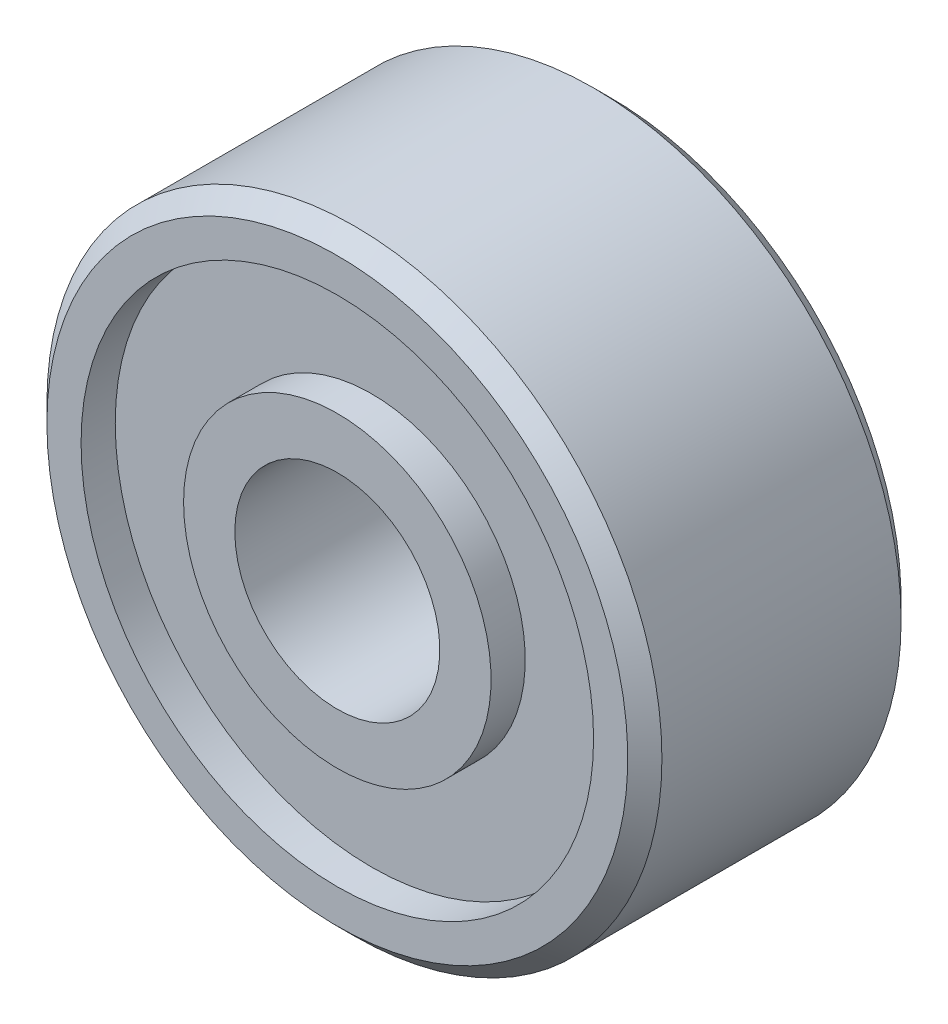
ISO-10303-21;
HEADER;
FILE_DESCRIPTION(('STEP AP214'),'2;1');
FILE_NAME('part.step','',(''),(''),'','','');
FILE_SCHEMA(('AUTOMOTIVE_DESIGN { 1 0 10303 214 1 1 1 1 }'));
ENDSEC;
DATA;
#1=APPLICATION_CONTEXT('core data for automotive mechanical design processes');
#2=APPLICATION_PROTOCOL_DEFINITION('international standard','automotive_design',2000,#1);
#3=PRODUCT_CONTEXT('',#1,'mechanical');
#4=PRODUCT('Part','Part','',(#3));
#5=PRODUCT_RELATED_PRODUCT_CATEGORY('part','',(#4));
#6=PRODUCT_DEFINITION_FORMATION('','',#4);
#7=PRODUCT_DEFINITION_CONTEXT('part definition',#1,'design');
#8=PRODUCT_DEFINITION('design','',#6,#7);
#9=PRODUCT_DEFINITION_SHAPE('','',#8);
#10=(LENGTH_UNIT() NAMED_UNIT(*) SI_UNIT(.MILLI.,.METRE.));
#11=(NAMED_UNIT(*) PLANE_ANGLE_UNIT() SI_UNIT($,.RADIAN.));
#12=(NAMED_UNIT(*) SI_UNIT($,.STERADIAN.) SOLID_ANGLE_UNIT());
#13=UNCERTAINTY_MEASURE_WITH_UNIT(LENGTH_MEASURE(1.E-05),#10,'distance_accuracy_value','');
#14=(GEOMETRIC_REPRESENTATION_CONTEXT(3) GLOBAL_UNCERTAINTY_ASSIGNED_CONTEXT((#13)) GLOBAL_UNIT_ASSIGNED_CONTEXT((#10,
#11,#12)) REPRESENTATION_CONTEXT('',''));
#15=CARTESIAN_POINT('',(0.,0.,0.));
#16=DIRECTION('',(0.,0.,1.));
#17=DIRECTION('',(1.,0.,0.));
#18=AXIS2_PLACEMENT_3D('',#15,#16,#17);
#19=CARTESIAN_POINT('',(0.,0.,2.5));
#20=DIRECTION('',(0.,0.,-1.));
#21=DIRECTION('',(-1.,0.,0.));
#22=AXIS2_PLACEMENT_3D('',#19,#20,#21);
#23=CYLINDRICAL_SURFACE('',#22,4.5);
#24=CARTESIAN_POINT('',(0.,0.,1.25));
#25=DIRECTION('',(0.,0.,-1.));
#26=DIRECTION('',(-1.,0.,0.));
#27=AXIS2_PLACEMENT_3D('',#24,#25,#26);
#28=CIRCLE('',#27,4.5);
#29=CARTESIAN_POINT('',(-4.5,0.,1.25));
#30=VERTEX_POINT('',#29);
#31=EDGE_CURVE('E10',#30,#30,#28,.T.);
#32=ORIENTED_EDGE('',*,*,#31,.T.);
#33=EDGE_LOOP('',(#32));
#34=FACE_BOUND('',#33,.T.);
#35=CARTESIAN_POINT('',(0.,0.,-2.25));
#36=DIRECTION('',(0.,0.,-1.));
#37=DIRECTION('',(-1.,0.,0.));
#38=AXIS2_PLACEMENT_3D('',#35,#36,#37);
#39=CIRCLE('',#38,4.5);
#40=CARTESIAN_POINT('',(-4.5,0.,-2.25));
#41=VERTEX_POINT('',#40);
#42=EDGE_CURVE('E78',#41,#41,#39,.T.);
#43=ORIENTED_EDGE('',*,*,#42,.F.);
#44=EDGE_LOOP('',(#43));
#45=FACE_BOUND('',#44,.T.);
#46=ADVANCED_FACE('F32',(#34,#45),#23,.T.);
#47=CARTESIAN_POINT('',(0.,0.,1.25));
#48=DIRECTION('',(0.,0.,-1.));
#49=DIRECTION('',(-1.,0.,0.));
#50=AXIS2_PLACEMENT_3D('',#47,#48,#49);
#51=CONICAL_SURFACE('',#50,4.5,0.785398163397453);
#52=CARTESIAN_POINT('',(0.,0.,1.5));
#53=DIRECTION('',(0.,0.,-1.));
#54=DIRECTION('',(-1.,0.,0.));
#55=AXIS2_PLACEMENT_3D('',#52,#53,#54);
#56=CIRCLE('',#55,4.24999999999999);
#57=CARTESIAN_POINT('',(-4.24999999999999,0.,1.5));
#58=VERTEX_POINT('',#57);
#59=EDGE_CURVE('E38',#58,#58,#56,.T.);
#60=ORIENTED_EDGE('',*,*,#59,.T.);
#61=EDGE_LOOP('',(#60));
#62=FACE_BOUND('',#61,.T.);
#63=ORIENTED_EDGE('',*,*,#31,.F.);
#64=EDGE_LOOP('',(#63));
#65=FACE_BOUND('',#64,.T.);
#66=ADVANCED_FACE('F86',(#62,#65),#51,.T.);
#67=CARTESIAN_POINT('',(4.24999999999999,0.,1.5));
#68=DIRECTION('',(0.,0.,1.));
#69=DIRECTION('',(1.,0.,0.));
#70=AXIS2_PLACEMENT_3D('',#67,#68,#69);
#71=PLANE('',#70);
#72=CARTESIAN_POINT('',(0.,0.,1.5));
#73=DIRECTION('',(0.,0.,-1.));
#74=DIRECTION('',(-1.,0.,0.));
#75=AXIS2_PLACEMENT_3D('',#72,#73,#74);
#76=CIRCLE('',#75,3.75);
#77=CARTESIAN_POINT('',(-3.75,0.,1.5));
#78=VERTEX_POINT('',#77);
#79=EDGE_CURVE('E42',#78,#78,#76,.T.);
#80=ORIENTED_EDGE('',*,*,#79,.T.);
#81=EDGE_LOOP('',(#80));
#82=FACE_BOUND('',#81,.T.);
#83=ORIENTED_EDGE('',*,*,#59,.F.);
#84=EDGE_LOOP('',(#83));
#85=FACE_BOUND('',#84,.T.);
#86=ADVANCED_FACE('F90',(#82,#85),#71,.T.);
#87=CARTESIAN_POINT('',(0.,0.,2.5));
#88=DIRECTION('',(0.,0.,-1.));
#89=DIRECTION('',(-1.,0.,0.));
#90=AXIS2_PLACEMENT_3D('',#87,#88,#89);
#91=CYLINDRICAL_SURFACE('',#90,3.75);
#92=CARTESIAN_POINT('',(0.,0.,1.));
#93=DIRECTION('',(0.,0.,-1.));
#94=DIRECTION('',(-1.,0.,0.));
#95=AXIS2_PLACEMENT_3D('',#92,#93,#94);
#96=CIRCLE('',#95,3.75);
#97=CARTESIAN_POINT('',(-3.75,0.,1.));
#98=VERTEX_POINT('',#97);
#99=EDGE_CURVE('E46',#98,#98,#96,.T.);
#100=ORIENTED_EDGE('',*,*,#99,.T.);
#101=EDGE_LOOP('',(#100));
#102=FACE_BOUND('',#101,.T.);
#103=ORIENTED_EDGE('',*,*,#79,.F.);
#104=EDGE_LOOP('',(#103));
#105=FACE_BOUND('',#104,.T.);
#106=ADVANCED_FACE('F94',(#102,#105),#91,.F.);
#107=CARTESIAN_POINT('',(3.75,0.,1.));
#108=DIRECTION('',(0.,0.,1.));
#109=DIRECTION('',(1.,0.,0.));
#110=AXIS2_PLACEMENT_3D('',#107,#108,#109);
#111=PLANE('',#110);
#112=CARTESIAN_POINT('',(0.,0.,1.));
#113=DIRECTION('',(0.,0.,-1.));
#114=DIRECTION('',(-1.,0.,0.));
#115=AXIS2_PLACEMENT_3D('',#112,#113,#114);
#116=CIRCLE('',#115,2.25);
#117=CARTESIAN_POINT('',(-2.25,0.,1.));
#118=VERTEX_POINT('',#117);
#119=EDGE_CURVE('E51',#118,#118,#116,.T.);
#120=ORIENTED_EDGE('',*,*,#119,.T.);
#121=EDGE_LOOP('',(#120));
#122=FACE_BOUND('',#121,.T.);
#123=ORIENTED_EDGE('',*,*,#99,.F.);
#124=EDGE_LOOP('',(#123));
#125=FACE_BOUND('',#124,.T.);
#126=ADVANCED_FACE('F101',(#122,#125),#111,.T.);
#127=CARTESIAN_POINT('',(0.,0.,2.5));
#128=DIRECTION('',(0.,0.,-1.));
#129=DIRECTION('',(-1.,0.,0.));
#130=AXIS2_PLACEMENT_3D('',#127,#128,#129);
#131=CYLINDRICAL_SURFACE('',#130,2.25);
#132=CARTESIAN_POINT('',(0.,0.,1.5));
#133=DIRECTION('',(0.,0.,-1.));
#134=DIRECTION('',(-1.,0.,0.));
#135=AXIS2_PLACEMENT_3D('',#132,#133,#134);
#136=CIRCLE('',#135,2.25);
#137=CARTESIAN_POINT('',(-2.25,0.,1.5));
#138=VERTEX_POINT('',#137);
#139=EDGE_CURVE('E54',#138,#138,#136,.T.);
#140=ORIENTED_EDGE('',*,*,#139,.T.);
#141=EDGE_LOOP('',(#140));
#142=FACE_BOUND('',#141,.T.);
#143=ORIENTED_EDGE('',*,*,#119,.F.);
#144=EDGE_LOOP('',(#143));
#145=FACE_BOUND('',#144,.T.);
#146=ADVANCED_FACE('F105',(#142,#145),#131,.T.);
#147=CARTESIAN_POINT('',(2.25,0.,1.5));
#148=DIRECTION('',(0.,0.,1.));
#149=DIRECTION('',(1.,0.,0.));
#150=AXIS2_PLACEMENT_3D('',#147,#148,#149);
#151=PLANE('',#150);
#152=CARTESIAN_POINT('',(0.,0.,1.5));
#153=DIRECTION('',(0.,0.,-1.));
#154=DIRECTION('',(-1.,0.,0.));
#155=AXIS2_PLACEMENT_3D('',#152,#153,#154);
#156=CIRCLE('',#155,1.5);
#157=CARTESIAN_POINT('',(-1.5,0.,1.5));
#158=VERTEX_POINT('',#157);
#159=EDGE_CURVE('E57',#158,#158,#156,.T.);
#160=ORIENTED_EDGE('',*,*,#159,.T.);
#161=EDGE_LOOP('',(#160));
#162=FACE_BOUND('',#161,.T.);
#163=ORIENTED_EDGE('',*,*,#139,.F.);
#164=EDGE_LOOP('',(#163));
#165=FACE_BOUND('',#164,.T.);
#166=ADVANCED_FACE('F109',(#162,#165),#151,.T.);
#167=CARTESIAN_POINT('',(0.,0.,2.5));
#168=DIRECTION('',(0.,0.,-1.));
#169=DIRECTION('',(-1.,0.,0.));
#170=AXIS2_PLACEMENT_3D('',#167,#168,#169);
#171=CYLINDRICAL_SURFACE('',#170,1.5);
#172=CARTESIAN_POINT('',(0.,0.,-2.5));
#173=DIRECTION('',(0.,0.,-1.));
#174=DIRECTION('',(-1.,0.,0.));
#175=AXIS2_PLACEMENT_3D('',#172,#173,#174);
#176=CIRCLE('',#175,1.5);
#177=CARTESIAN_POINT('',(-1.5,0.,-2.5));
#178=VERTEX_POINT('',#177);
#179=EDGE_CURVE('E60',#178,#178,#176,.T.);
#180=ORIENTED_EDGE('',*,*,#179,.T.);
#181=EDGE_LOOP('',(#180));
#182=FACE_BOUND('',#181,.T.);
#183=ORIENTED_EDGE('',*,*,#159,.F.);
#184=EDGE_LOOP('',(#183));
#185=FACE_BOUND('',#184,.T.);
#186=ADVANCED_FACE('F113',(#182,#185),#171,.F.);
#187=CARTESIAN_POINT('',(1.5,0.,-2.5));
#188=DIRECTION('',(0.,0.,-1.));
#189=DIRECTION('',(-1.,0.,0.));
#190=AXIS2_PLACEMENT_3D('',#187,#188,#189);
#191=PLANE('',#190);
#192=CARTESIAN_POINT('',(0.,0.,-2.5));
#193=DIRECTION('',(0.,0.,-1.));
#194=DIRECTION('',(-1.,0.,0.));
#195=AXIS2_PLACEMENT_3D('',#192,#193,#194);
#196=CIRCLE('',#195,2.25);
#197=CARTESIAN_POINT('',(-2.25,0.,-2.5));
#198=VERTEX_POINT('',#197);
#199=EDGE_CURVE('E63',#198,#198,#196,.T.);
#200=ORIENTED_EDGE('',*,*,#199,.T.);
#201=EDGE_LOOP('',(#200));
#202=FACE_BOUND('',#201,.T.);
#203=ORIENTED_EDGE('',*,*,#179,.F.);
#204=EDGE_LOOP('',(#203));
#205=FACE_BOUND('',#204,.T.);
#206=ADVANCED_FACE('F117',(#202,#205),#191,.T.);
#207=CARTESIAN_POINT('',(0.,0.,2.5));
#208=DIRECTION('',(0.,0.,-1.));
#209=DIRECTION('',(-1.,0.,0.));
#210=AXIS2_PLACEMENT_3D('',#207,#208,#209);
#211=CYLINDRICAL_SURFACE('',#210,2.25);
#212=CARTESIAN_POINT('',(0.,0.,-2.));
#213=DIRECTION('',(0.,0.,-1.));
#214=DIRECTION('',(-1.,0.,0.));
#215=AXIS2_PLACEMENT_3D('',#212,#213,#214);
#216=CIRCLE('',#215,2.25);
#217=CARTESIAN_POINT('',(-2.25,0.,-2.));
#218=VERTEX_POINT('',#217);
#219=EDGE_CURVE('E66',#218,#218,#216,.T.);
#220=ORIENTED_EDGE('',*,*,#219,.T.);
#221=EDGE_LOOP('',(#220));
#222=FACE_BOUND('',#221,.T.);
#223=ORIENTED_EDGE('',*,*,#199,.F.);
#224=EDGE_LOOP('',(#223));
#225=FACE_BOUND('',#224,.T.);
#226=ADVANCED_FACE('F121',(#222,#225),#211,.T.);
#227=CARTESIAN_POINT('',(2.25,0.,-2.));
#228=DIRECTION('',(0.,0.,-1.));
#229=DIRECTION('',(-1.,0.,0.));
#230=AXIS2_PLACEMENT_3D('',#227,#228,#229);
#231=PLANE('',#230);
#232=CARTESIAN_POINT('',(0.,0.,-2.));
#233=DIRECTION('',(0.,0.,-1.));
#234=DIRECTION('',(-1.,0.,0.));
#235=AXIS2_PLACEMENT_3D('',#232,#233,#234);
#236=CIRCLE('',#235,3.75);
#237=CARTESIAN_POINT('',(-3.75,0.,-2.));
#238=VERTEX_POINT('',#237);
#239=EDGE_CURVE('E69',#238,#238,#236,.T.);
#240=ORIENTED_EDGE('',*,*,#239,.T.);
#241=EDGE_LOOP('',(#240));
#242=FACE_BOUND('',#241,.T.);
#243=ORIENTED_EDGE('',*,*,#219,.F.);
#244=EDGE_LOOP('',(#243));
#245=FACE_BOUND('',#244,.T.);
#246=ADVANCED_FACE('F125',(#242,#245),#231,.T.);
#247=CARTESIAN_POINT('',(0.,0.,2.5));
#248=DIRECTION('',(0.,0.,-1.));
#249=DIRECTION('',(-1.,0.,0.));
#250=AXIS2_PLACEMENT_3D('',#247,#248,#249);
#251=CYLINDRICAL_SURFACE('',#250,3.75);
#252=CARTESIAN_POINT('',(0.,0.,-2.5));
#253=DIRECTION('',(0.,0.,-1.));
#254=DIRECTION('',(-1.,0.,0.));
#255=AXIS2_PLACEMENT_3D('',#252,#253,#254);
#256=CIRCLE('',#255,3.75);
#257=CARTESIAN_POINT('',(-3.75,0.,-2.5));
#258=VERTEX_POINT('',#257);
#259=EDGE_CURVE('E72',#258,#258,#256,.T.);
#260=ORIENTED_EDGE('',*,*,#259,.T.);
#261=EDGE_LOOP('',(#260));
#262=FACE_BOUND('',#261,.T.);
#263=ORIENTED_EDGE('',*,*,#239,.F.);
#264=EDGE_LOOP('',(#263));
#265=FACE_BOUND('',#264,.T.);
#266=ADVANCED_FACE('F129',(#262,#265),#251,.F.);
#267=CARTESIAN_POINT('',(3.75,0.,-2.5));
#268=DIRECTION('',(0.,0.,-1.));
#269=DIRECTION('',(-1.,0.,0.));
#270=AXIS2_PLACEMENT_3D('',#267,#268,#269);
#271=PLANE('',#270);
#272=CARTESIAN_POINT('',(0.,0.,-2.5));
#273=DIRECTION('',(0.,0.,-1.));
#274=DIRECTION('',(-1.,0.,0.));
#275=AXIS2_PLACEMENT_3D('',#272,#273,#274);
#276=CIRCLE('',#275,4.24999999999999);
#277=CARTESIAN_POINT('',(-4.24999999999999,0.,-2.5));
#278=VERTEX_POINT('',#277);
#279=EDGE_CURVE('E75',#278,#278,#276,.T.);
#280=ORIENTED_EDGE('',*,*,#279,.T.);
#281=EDGE_LOOP('',(#280));
#282=FACE_BOUND('',#281,.T.);
#283=ORIENTED_EDGE('',*,*,#259,.F.);
#284=EDGE_LOOP('',(#283));
#285=FACE_BOUND('',#284,.T.);
#286=ADVANCED_FACE('F133',(#282,#285),#271,.T.);
#287=CARTESIAN_POINT('',(0.,0.,-2.5));
#288=DIRECTION('',(0.,0.,1.));
#289=DIRECTION('',(1.,0.,0.));
#290=AXIS2_PLACEMENT_3D('',#287,#288,#289);
#291=CONICAL_SURFACE('',#290,4.24999999999999,0.785398163397453);
#292=ORIENTED_EDGE('',*,*,#42,.T.);
#293=EDGE_LOOP('',(#292));
#294=FACE_BOUND('',#293,.T.);
#295=ORIENTED_EDGE('',*,*,#279,.F.);
#296=EDGE_LOOP('',(#295));
#297=FACE_BOUND('',#296,.T.);
#298=ADVANCED_FACE('F82',(#294,#297),#291,.T.);
#299=CLOSED_SHELL('',(#46,#66,#86,#106,#126,#146,#166,#186,#206,#226,#246,#266,#286,#298));
#300=MANIFOLD_SOLID_BREP('B2',#299);
#301=ADVANCED_BREP_SHAPE_REPRESENTATION('',(#18,#300),#14);
#302=SHAPE_DEFINITION_REPRESENTATION(#9,#301);
ENDSEC;
END-ISO-10303-21;
